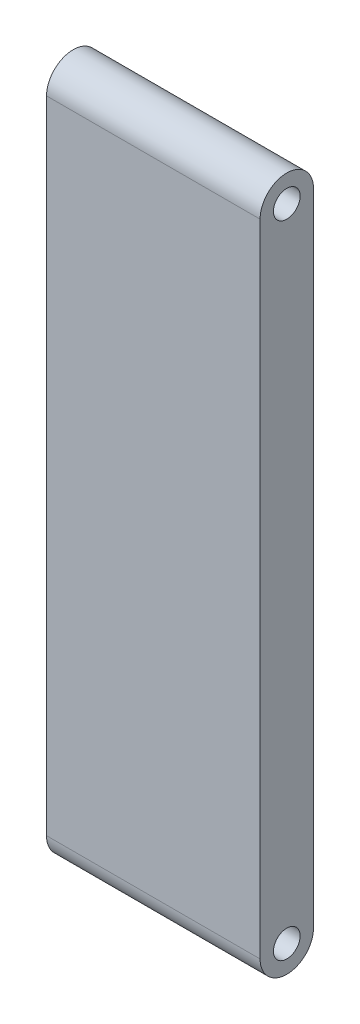
ISO-10303-21;
HEADER;
FILE_DESCRIPTION(('STEP AP214'),'2;1');
FILE_NAME('part.step','',(''),(''),'','','');
FILE_SCHEMA(('AUTOMOTIVE_DESIGN { 1 0 10303 214 1 1 1 1 }'));
ENDSEC;
DATA;
#1=APPLICATION_CONTEXT('core data for automotive mechanical design processes');
#2=APPLICATION_PROTOCOL_DEFINITION('international standard','automotive_design',2000,#1);
#3=PRODUCT_CONTEXT('',#1,'mechanical');
#4=PRODUCT('Part','Part','',(#3));
#5=PRODUCT_RELATED_PRODUCT_CATEGORY('part','',(#4));
#6=PRODUCT_DEFINITION_FORMATION('','',#4);
#7=PRODUCT_DEFINITION_CONTEXT('part definition',#1,'design');
#8=PRODUCT_DEFINITION('design','',#6,#7);
#9=PRODUCT_DEFINITION_SHAPE('','',#8);
#10=(LENGTH_UNIT() NAMED_UNIT(*) SI_UNIT(.MILLI.,.METRE.));
#11=(NAMED_UNIT(*) PLANE_ANGLE_UNIT() SI_UNIT($,.RADIAN.));
#12=(NAMED_UNIT(*) SI_UNIT($,.STERADIAN.) SOLID_ANGLE_UNIT());
#13=UNCERTAINTY_MEASURE_WITH_UNIT(LENGTH_MEASURE(1.E-05),#10,'distance_accuracy_value','');
#14=(GEOMETRIC_REPRESENTATION_CONTEXT(3) GLOBAL_UNCERTAINTY_ASSIGNED_CONTEXT((#13)) GLOBAL_UNIT_ASSIGNED_CONTEXT((#10,
#11,#12)) REPRESENTATION_CONTEXT('',''));
#15=CARTESIAN_POINT('',(0.,0.,0.));
#16=DIRECTION('',(0.,0.,1.));
#17=DIRECTION('',(1.,0.,0.));
#18=AXIS2_PLACEMENT_3D('',#15,#16,#17);
#19=CARTESIAN_POINT('',(0.,0.,5.));
#20=DIRECTION('',(1.,0.,0.));
#21=DIRECTION('',(0.,0.,-1.));
#22=AXIS2_PLACEMENT_3D('',#19,#20,#21);
#23=PLANE('',#22);
#24=DIRECTION('',(0.,-1.,0.));
#25=VECTOR('',#24,1.);
#26=CARTESIAN_POINT('',(0.,0.,0.));
#27=LINE('',#26,#25);
#28=CARTESIAN_POINT('',(0.,60.,0.));
#29=VERTEX_POINT('',#28);
#30=CARTESIAN_POINT('',(0.,0.,0.));
#31=VERTEX_POINT('',#30);
#32=EDGE_CURVE('E86',#29,#31,#27,.T.);
#33=ORIENTED_EDGE('',*,*,#32,.T.);
#34=CARTESIAN_POINT('',(0.,0.,2.5));
#35=DIRECTION('',(-1.,0.,0.));
#36=DIRECTION('',(0.,0.,1.));
#37=AXIS2_PLACEMENT_3D('',#34,#35,#36);
#38=CIRCLE('',#37,2.5);
#39=CARTESIAN_POINT('',(0.,0.,5.));
#40=VERTEX_POINT('',#39);
#41=EDGE_CURVE('E85',#31,#40,#38,.T.);
#42=ORIENTED_EDGE('',*,*,#41,.T.);
#43=DIRECTION('',(0.,-1.,0.));
#44=VECTOR('',#43,1.);
#45=CARTESIAN_POINT('',(0.,0.,5.));
#46=LINE('',#45,#44);
#47=CARTESIAN_POINT('',(0.,60.,5.));
#48=VERTEX_POINT('',#47);
#49=EDGE_CURVE('E110',#48,#40,#46,.T.);
#50=ORIENTED_EDGE('',*,*,#49,.F.);
#51=CARTESIAN_POINT('',(0.,60.,2.5));
#52=DIRECTION('',(1.,0.,0.));
#53=DIRECTION('',(0.,0.,-1.));
#54=AXIS2_PLACEMENT_3D('',#51,#52,#53);
#55=CIRCLE('',#54,2.5);
#56=EDGE_CURVE('E51',#48,#29,#55,.F.);
#57=ORIENTED_EDGE('',*,*,#56,.T.);
#58=EDGE_LOOP('',(#33,#42,#50,#57));
#59=FACE_BOUND('',#58,.T.);
#60=CARTESIAN_POINT('',(0.,60.,2.5));
#61=DIRECTION('',(1.,0.,0.));
#62=DIRECTION('',(0.,0.,-1.));
#63=AXIS2_PLACEMENT_3D('',#60,#61,#62);
#64=CIRCLE('',#63,1.25);
#65=CARTESIAN_POINT('',(0.,60.,1.25));
#66=VERTEX_POINT('',#65);
#67=EDGE_CURVE('E103',#66,#66,#64,.F.);
#68=ORIENTED_EDGE('',*,*,#67,.F.);
#69=EDGE_LOOP('',(#68));
#70=FACE_BOUND('',#69,.T.);
#71=CARTESIAN_POINT('',(0.,0.,2.5));
#72=DIRECTION('',(-1.,0.,0.));
#73=DIRECTION('',(0.,0.,1.));
#74=AXIS2_PLACEMENT_3D('',#71,#72,#73);
#75=CIRCLE('',#74,1.25);
#76=CARTESIAN_POINT('',(0.,0.,3.75));
#77=VERTEX_POINT('',#76);
#78=EDGE_CURVE('E97',#77,#77,#75,.T.);
#79=ORIENTED_EDGE('',*,*,#78,.F.);
#80=EDGE_LOOP('',(#79));
#81=FACE_BOUND('',#80,.T.);
#82=ADVANCED_FACE('F33',(#59,#70,#81),#23,.F.);
#83=CARTESIAN_POINT('',(20.,0.,5.));
#84=DIRECTION('',(-1.,0.,0.));
#85=DIRECTION('',(0.,0.,1.));
#86=AXIS2_PLACEMENT_3D('',#83,#84,#85);
#87=PLANE('',#86);
#88=CARTESIAN_POINT('',(20.,0.,2.5));
#89=DIRECTION('',(-1.,0.,0.));
#90=DIRECTION('',(0.,0.,1.));
#91=AXIS2_PLACEMENT_3D('',#88,#89,#90);
#92=CIRCLE('',#91,1.25);
#93=CARTESIAN_POINT('',(20.,0.,3.75));
#94=VERTEX_POINT('',#93);
#95=EDGE_CURVE('E92',#94,#94,#92,.F.);
#96=ORIENTED_EDGE('',*,*,#95,.F.);
#97=EDGE_LOOP('',(#96));
#98=FACE_BOUND('',#97,.T.);
#99=DIRECTION('',(0.,1.,0.));
#100=VECTOR('',#99,1.);
#101=CARTESIAN_POINT('',(20.,0.,5.));
#102=LINE('',#101,#100);
#103=CARTESIAN_POINT('',(20.,0.,5.));
#104=VERTEX_POINT('',#103);
#105=CARTESIAN_POINT('',(20.,60.,5.));
#106=VERTEX_POINT('',#105);
#107=EDGE_CURVE('E42',#104,#106,#102,.T.);
#108=ORIENTED_EDGE('',*,*,#107,.F.);
#109=CARTESIAN_POINT('',(20.,0.,2.5));
#110=DIRECTION('',(-1.,0.,0.));
#111=DIRECTION('',(0.,0.,1.));
#112=AXIS2_PLACEMENT_3D('',#109,#110,#111);
#113=CIRCLE('',#112,2.5);
#114=CARTESIAN_POINT('',(20.,0.,0.));
#115=VERTEX_POINT('',#114);
#116=EDGE_CURVE('E82',#104,#115,#113,.F.);
#117=ORIENTED_EDGE('',*,*,#116,.T.);
#118=DIRECTION('',(0.,1.,0.));
#119=VECTOR('',#118,1.);
#120=CARTESIAN_POINT('',(20.,0.,0.));
#121=LINE('',#120,#119);
#122=CARTESIAN_POINT('',(20.,60.,0.));
#123=VERTEX_POINT('',#122);
#124=EDGE_CURVE('E75',#115,#123,#121,.T.);
#125=ORIENTED_EDGE('',*,*,#124,.T.);
#126=CARTESIAN_POINT('',(20.,60.,2.5));
#127=DIRECTION('',(1.,0.,0.));
#128=DIRECTION('',(0.,0.,-1.));
#129=AXIS2_PLACEMENT_3D('',#126,#127,#128);
#130=CIRCLE('',#129,2.5);
#131=EDGE_CURVE('E104',#123,#106,#130,.T.);
#132=ORIENTED_EDGE('',*,*,#131,.T.);
#133=EDGE_LOOP('',(#108,#117,#125,#132));
#134=FACE_BOUND('',#133,.T.);
#135=CARTESIAN_POINT('',(20.,60.,2.5));
#136=DIRECTION('',(1.,0.,0.));
#137=DIRECTION('',(0.,0.,-1.));
#138=AXIS2_PLACEMENT_3D('',#135,#136,#137);
#139=CIRCLE('',#138,1.25);
#140=CARTESIAN_POINT('',(20.,60.,1.25));
#141=VERTEX_POINT('',#140);
#142=EDGE_CURVE('E95',#141,#141,#139,.T.);
#143=ORIENTED_EDGE('',*,*,#142,.F.);
#144=EDGE_LOOP('',(#143));
#145=FACE_BOUND('',#144,.T.);
#146=ADVANCED_FACE('F89',(#98,#134,#145),#87,.F.);
#147=CARTESIAN_POINT('',(0.,0.,5.));
#148=DIRECTION('',(0.,0.,-1.));
#149=DIRECTION('',(-1.,0.,0.));
#150=AXIS2_PLACEMENT_3D('',#147,#148,#149);
#151=PLANE('',#150);
#152=ORIENTED_EDGE('',*,*,#49,.T.);
#153=DIRECTION('',(1.,0.,0.));
#154=VECTOR('',#153,1.);
#155=CARTESIAN_POINT('',(0.,0.,5.));
#156=LINE('',#155,#154);
#157=EDGE_CURVE('E113',#40,#104,#156,.T.);
#158=ORIENTED_EDGE('',*,*,#157,.T.);
#159=ORIENTED_EDGE('',*,*,#107,.T.);
#160=DIRECTION('',(-1.,0.,0.));
#161=VECTOR('',#160,1.);
#162=CARTESIAN_POINT('',(0.,60.,5.));
#163=LINE('',#162,#161);
#164=EDGE_CURVE('E11',#106,#48,#163,.T.);
#165=ORIENTED_EDGE('',*,*,#164,.T.);
#166=EDGE_LOOP('',(#152,#158,#159,#165));
#167=FACE_BOUND('',#166,.T.);
#168=ADVANCED_FACE('F121',(#167),#151,.F.);
#169=CARTESIAN_POINT('',(0.,0.,0.));
#170=DIRECTION('',(0.,0.,-1.));
#171=DIRECTION('',(-1.,0.,0.));
#172=AXIS2_PLACEMENT_3D('',#169,#170,#171);
#173=PLANE('',#172);
#174=ORIENTED_EDGE('',*,*,#32,.F.);
#175=DIRECTION('',(-1.,0.,0.));
#176=VECTOR('',#175,1.);
#177=CARTESIAN_POINT('',(0.,60.,0.));
#178=LINE('',#177,#176);
#179=EDGE_CURVE('E36',#123,#29,#178,.T.);
#180=ORIENTED_EDGE('',*,*,#179,.F.);
#181=ORIENTED_EDGE('',*,*,#124,.F.);
#182=DIRECTION('',(1.,0.,0.));
#183=VECTOR('',#182,1.);
#184=CARTESIAN_POINT('',(0.,0.,0.));
#185=LINE('',#184,#183);
#186=EDGE_CURVE('E62',#31,#115,#185,.T.);
#187=ORIENTED_EDGE('',*,*,#186,.F.);
#188=EDGE_LOOP('',(#174,#180,#181,#187));
#189=FACE_BOUND('',#188,.T.);
#190=ADVANCED_FACE('F76',(#189),#173,.T.);
#191=CARTESIAN_POINT('',(-7.07106781186548,60.,2.5));
#192=DIRECTION('',(1.,0.,0.));
#193=DIRECTION('',(0.,0.,-1.));
#194=AXIS2_PLACEMENT_3D('',#191,#192,#193);
#195=CYLINDRICAL_SURFACE('',#194,1.25);
#196=ORIENTED_EDGE('',*,*,#67,.T.);
#197=EDGE_LOOP('',(#196));
#198=FACE_BOUND('',#197,.T.);
#199=ORIENTED_EDGE('',*,*,#142,.T.);
#200=EDGE_LOOP('',(#199));
#201=FACE_BOUND('',#200,.T.);
#202=ADVANCED_FACE('F128',(#198,#201),#195,.F.);
#203=CARTESIAN_POINT('',(-7.07106781186548,60.,2.5));
#204=DIRECTION('',(1.,0.,0.));
#205=DIRECTION('',(0.,0.,-1.));
#206=AXIS2_PLACEMENT_3D('',#203,#204,#205);
#207=CYLINDRICAL_SURFACE('',#206,2.5);
#208=ORIENTED_EDGE('',*,*,#56,.F.);
#209=ORIENTED_EDGE('',*,*,#164,.F.);
#210=ORIENTED_EDGE('',*,*,#131,.F.);
#211=ORIENTED_EDGE('',*,*,#179,.T.);
#212=EDGE_LOOP('',(#208,#209,#210,#211));
#213=FACE_BOUND('',#212,.T.);
#214=ADVANCED_FACE('F119',(#213),#207,.T.);
#215=CARTESIAN_POINT('',(27.0710678118655,0.,2.5));
#216=DIRECTION('',(-1.,0.,0.));
#217=DIRECTION('',(0.,0.,1.));
#218=AXIS2_PLACEMENT_3D('',#215,#216,#217);
#219=CYLINDRICAL_SURFACE('',#218,1.25);
#220=ORIENTED_EDGE('',*,*,#95,.T.);
#221=EDGE_LOOP('',(#220));
#222=FACE_BOUND('',#221,.T.);
#223=ORIENTED_EDGE('',*,*,#78,.T.);
#224=EDGE_LOOP('',(#223));
#225=FACE_BOUND('',#224,.T.);
#226=ADVANCED_FACE('F147',(#222,#225),#219,.F.);
#227=CARTESIAN_POINT('',(27.0710678118655,0.,2.5));
#228=DIRECTION('',(-1.,0.,0.));
#229=DIRECTION('',(0.,0.,1.));
#230=AXIS2_PLACEMENT_3D('',#227,#228,#229);
#231=CYLINDRICAL_SURFACE('',#230,2.5);
#232=ORIENTED_EDGE('',*,*,#116,.F.);
#233=ORIENTED_EDGE('',*,*,#157,.F.);
#234=ORIENTED_EDGE('',*,*,#41,.F.);
#235=ORIENTED_EDGE('',*,*,#186,.T.);
#236=EDGE_LOOP('',(#232,#233,#234,#235));
#237=FACE_BOUND('',#236,.T.);
#238=ADVANCED_FACE('F81',(#237),#231,.T.);
#239=CLOSED_SHELL('',(#82,#146,#168,#190,#202,#214,#226,#238));
#240=MANIFOLD_SOLID_BREP('B2',#239);
#241=ADVANCED_BREP_SHAPE_REPRESENTATION('',(#18,#240),#14);
#242=SHAPE_DEFINITION_REPRESENTATION(#9,#241);
ENDSEC;
END-ISO-10303-21;
